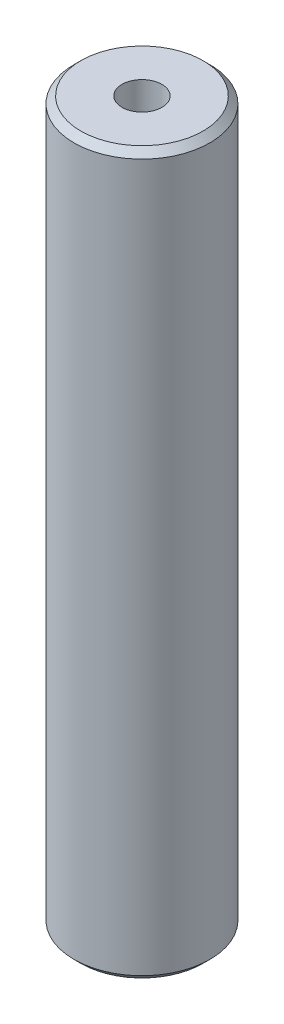
ISO-10303-21;
HEADER;
FILE_DESCRIPTION(('STEP AP214'),'2;1');
FILE_NAME('part.step','',(''),(''),'','','');
FILE_SCHEMA(('AUTOMOTIVE_DESIGN { 1 0 10303 214 1 1 1 1 }'));
ENDSEC;
DATA;
#1=APPLICATION_CONTEXT('core data for automotive mechanical design processes');
#2=APPLICATION_PROTOCOL_DEFINITION('international standard','automotive_design',2000,#1);
#3=PRODUCT_CONTEXT('',#1,'mechanical');
#4=PRODUCT('Part','Part','',(#3));
#5=PRODUCT_RELATED_PRODUCT_CATEGORY('part','',(#4));
#6=PRODUCT_DEFINITION_FORMATION('','',#4);
#7=PRODUCT_DEFINITION_CONTEXT('part definition',#1,'design');
#8=PRODUCT_DEFINITION('design','',#6,#7);
#9=PRODUCT_DEFINITION_SHAPE('','',#8);
#10=(LENGTH_UNIT() NAMED_UNIT(*) SI_UNIT(.MILLI.,.METRE.));
#11=(NAMED_UNIT(*) PLANE_ANGLE_UNIT() SI_UNIT($,.RADIAN.));
#12=(NAMED_UNIT(*) SI_UNIT($,.STERADIAN.) SOLID_ANGLE_UNIT());
#13=UNCERTAINTY_MEASURE_WITH_UNIT(LENGTH_MEASURE(1.E-05),#10,'distance_accuracy_value','');
#14=(GEOMETRIC_REPRESENTATION_CONTEXT(3) GLOBAL_UNCERTAINTY_ASSIGNED_CONTEXT((#13)) GLOBAL_UNIT_ASSIGNED_CONTEXT((#10,
#11,#12)) REPRESENTATION_CONTEXT('',''));
#15=CARTESIAN_POINT('',(0.,0.,0.));
#16=DIRECTION('',(0.,0.,1.));
#17=DIRECTION('',(1.,0.,0.));
#18=AXIS2_PLACEMENT_3D('',#15,#16,#17);
#19=CARTESIAN_POINT('',(0.,106.173128394533,0.));
#20=DIRECTION('',(0.,-1.,0.));
#21=DIRECTION('',(0.,0.,-1.));
#22=AXIS2_PLACEMENT_3D('',#19,#20,#21);
#23=CYLINDRICAL_SURFACE('',#22,10.);
#24=CARTESIAN_POINT('',(0.,105.169539576771,0.));
#25=DIRECTION('',(0.,1.,0.));
#26=DIRECTION('',(0.,0.,1.));
#27=AXIS2_PLACEMENT_3D('',#24,#25,#26);
#28=CIRCLE('',#27,10.);
#29=CARTESIAN_POINT('',(0.,105.169539576771,10.));
#30=VERTEX_POINT('',#29);
#31=EDGE_CURVE('E50',#30,#30,#28,.F.);
#32=ORIENTED_EDGE('',*,*,#31,.T.);
#33=EDGE_LOOP('',(#32));
#34=FACE_BOUND('',#33,.T.);
#35=CARTESIAN_POINT('',(0.,1.00358881776241,0.));
#36=DIRECTION('',(0.,1.,0.));
#37=DIRECTION('',(0.,0.,1.));
#38=AXIS2_PLACEMENT_3D('',#35,#36,#37);
#39=CIRCLE('',#38,10.);
#40=CARTESIAN_POINT('',(0.,1.00358881776241,10.));
#41=VERTEX_POINT('',#40);
#42=EDGE_CURVE('E51',#41,#41,#39,.T.);
#43=ORIENTED_EDGE('',*,*,#42,.T.);
#44=EDGE_LOOP('',(#43));
#45=FACE_BOUND('',#44,.T.);
#46=ADVANCED_FACE('F39',(#34,#45),#23,.T.);
#47=CARTESIAN_POINT('',(0.,106.173128394533,0.));
#48=DIRECTION('',(0.,1.,0.));
#49=DIRECTION('',(0.,0.,1.));
#50=AXIS2_PLACEMENT_3D('',#47,#48,#49);
#51=PLANE('',#50);
#52=CARTESIAN_POINT('',(0.,106.173128394533,0.));
#53=DIRECTION('',(0.,1.,0.));
#54=DIRECTION('',(0.,0.,1.));
#55=AXIS2_PLACEMENT_3D('',#52,#53,#54);
#56=CIRCLE('',#55,8.99641118223758);
#57=CARTESIAN_POINT('',(0.,106.173128394533,8.99641118223758));
#58=VERTEX_POINT('',#57);
#59=EDGE_CURVE('E54',#58,#58,#56,.T.);
#60=ORIENTED_EDGE('',*,*,#59,.T.);
#61=EDGE_LOOP('',(#60));
#62=FACE_BOUND('',#61,.T.);
#63=CARTESIAN_POINT('',(0.,106.173128394533,0.));
#64=DIRECTION('',(0.,1.,0.));
#65=DIRECTION('',(0.,0.,1.));
#66=AXIS2_PLACEMENT_3D('',#63,#64,#65);
#67=CIRCLE('',#66,2.94014338273099);
#68=CARTESIAN_POINT('',(0.,106.173128394533,2.94014338273099));
#69=VERTEX_POINT('',#68);
#70=EDGE_CURVE('E58',#69,#69,#67,.T.);
#71=ORIENTED_EDGE('',*,*,#70,.F.);
#72=EDGE_LOOP('',(#71));
#73=FACE_BOUND('',#72,.T.);
#74=ADVANCED_FACE('F69',(#62,#73),#51,.T.);
#75=CARTESIAN_POINT('',(0.,0.,0.));
#76=DIRECTION('',(0.,1.,0.));
#77=DIRECTION('',(0.,0.,1.));
#78=AXIS2_PLACEMENT_3D('',#75,#76,#77);
#79=PLANE('',#78);
#80=CARTESIAN_POINT('',(0.,0.,0.));
#81=DIRECTION('',(0.,1.,0.));
#82=DIRECTION('',(0.,0.,1.));
#83=AXIS2_PLACEMENT_3D('',#80,#81,#82);
#84=CIRCLE('',#83,8.99641118223758);
#85=CARTESIAN_POINT('',(0.,0.,8.99641118223758));
#86=VERTEX_POINT('',#85);
#87=EDGE_CURVE('E10',#86,#86,#84,.F.);
#88=ORIENTED_EDGE('',*,*,#87,.T.);
#89=EDGE_LOOP('',(#88));
#90=FACE_BOUND('',#89,.T.);
#91=CARTESIAN_POINT('',(0.,0.,0.));
#92=DIRECTION('',(0.,1.,0.));
#93=DIRECTION('',(0.,0.,1.));
#94=AXIS2_PLACEMENT_3D('',#91,#92,#93);
#95=CIRCLE('',#94,2.94014338273099);
#96=CARTESIAN_POINT('',(0.,0.,2.94014338273099));
#97=VERTEX_POINT('',#96);
#98=EDGE_CURVE('E63',#97,#97,#95,.T.);
#99=ORIENTED_EDGE('',*,*,#98,.T.);
#100=EDGE_LOOP('',(#99));
#101=FACE_BOUND('',#100,.T.);
#102=ADVANCED_FACE('F75',(#90,#101),#79,.F.);
#103=CARTESIAN_POINT('',(0.,106.173128394533,0.));
#104=DIRECTION('',(0.,-1.,0.));
#105=DIRECTION('',(0.,0.,-1.));
#106=AXIS2_PLACEMENT_3D('',#103,#104,#105);
#107=CYLINDRICAL_SURFACE('',#106,2.94014338273099);
#108=ORIENTED_EDGE('',*,*,#70,.T.);
#109=EDGE_LOOP('',(#108));
#110=FACE_BOUND('',#109,.T.);
#111=ORIENTED_EDGE('',*,*,#98,.F.);
#112=EDGE_LOOP('',(#111));
#113=FACE_BOUND('',#112,.T.);
#114=ADVANCED_FACE('F70',(#110,#113),#107,.F.);
#115=CARTESIAN_POINT('',(0.,106.173128394533,0.));
#116=DIRECTION('',(0.,-1.,0.));
#117=DIRECTION('',(0.,0.,-1.));
#118=AXIS2_PLACEMENT_3D('',#115,#116,#117);
#119=CONICAL_SURFACE('',#118,8.99641118223758,0.785398163397451);
#120=ORIENTED_EDGE('',*,*,#31,.F.);
#121=EDGE_LOOP('',(#120));
#122=FACE_BOUND('',#121,.T.);
#123=ORIENTED_EDGE('',*,*,#59,.F.);
#124=EDGE_LOOP('',(#123));
#125=FACE_BOUND('',#124,.T.);
#126=ADVANCED_FACE('F81',(#122,#125),#119,.T.);
#127=CARTESIAN_POINT('',(0.,1.00358881776241,0.));
#128=DIRECTION('',(0.,1.,0.));
#129=DIRECTION('',(0.,0.,1.));
#130=AXIS2_PLACEMENT_3D('',#127,#128,#129);
#131=CONICAL_SURFACE('',#130,10.,0.785398163397451);
#132=ORIENTED_EDGE('',*,*,#87,.F.);
#133=EDGE_LOOP('',(#132));
#134=FACE_BOUND('',#133,.T.);
#135=ORIENTED_EDGE('',*,*,#42,.F.);
#136=EDGE_LOOP('',(#135));
#137=FACE_BOUND('',#136,.T.);
#138=ADVANCED_FACE('F45',(#134,#137),#131,.T.);
#139=CLOSED_SHELL('',(#46,#74,#102,#114,#126,#138));
#140=MANIFOLD_SOLID_BREP('B2',#139);
#141=ADVANCED_BREP_SHAPE_REPRESENTATION('',(#18,#140),#14);
#142=SHAPE_DEFINITION_REPRESENTATION(#9,#141);
ENDSEC;
END-ISO-10303-21;
